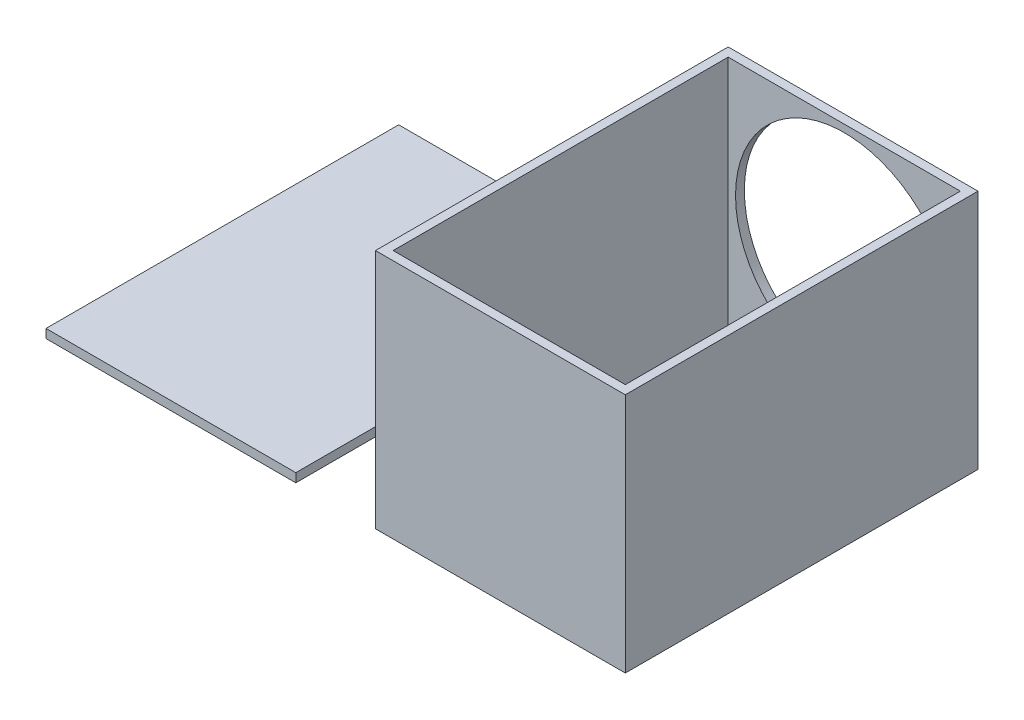
ISO-10303-21;
HEADER;
FILE_DESCRIPTION(('STEP AP214'),'2;1');
FILE_NAME('part.step','',(''),(''),'','','');
FILE_SCHEMA(('AUTOMOTIVE_DESIGN { 1 0 10303 214 1 1 1 1 }'));
ENDSEC;
DATA;
#1=APPLICATION_CONTEXT('core data for automotive mechanical design processes');
#2=APPLICATION_PROTOCOL_DEFINITION('international standard','automotive_design',2000,#1);
#3=PRODUCT_CONTEXT('',#1,'mechanical');
#4=PRODUCT('Part','Part','',(#3));
#5=PRODUCT_RELATED_PRODUCT_CATEGORY('part','',(#4));
#6=PRODUCT_DEFINITION_FORMATION('','',#4);
#7=PRODUCT_DEFINITION_CONTEXT('part definition',#1,'design');
#8=PRODUCT_DEFINITION('design','',#6,#7);
#9=PRODUCT_DEFINITION_SHAPE('','',#8);
#10=(LENGTH_UNIT() NAMED_UNIT(*) SI_UNIT(.MILLI.,.METRE.));
#11=(NAMED_UNIT(*) PLANE_ANGLE_UNIT() SI_UNIT($,.RADIAN.));
#12=(NAMED_UNIT(*) SI_UNIT($,.STERADIAN.) SOLID_ANGLE_UNIT());
#13=UNCERTAINTY_MEASURE_WITH_UNIT(LENGTH_MEASURE(1.E-05),#10,'distance_accuracy_value','');
#14=(GEOMETRIC_REPRESENTATION_CONTEXT(3) GLOBAL_UNCERTAINTY_ASSIGNED_CONTEXT((#13)) GLOBAL_UNIT_ASSIGNED_CONTEXT((#10,
#11,#12)) REPRESENTATION_CONTEXT('',''));
#15=CARTESIAN_POINT('',(0.,0.,0.));
#16=DIRECTION('',(0.,0.,1.));
#17=DIRECTION('',(1.,0.,0.));
#18=AXIS2_PLACEMENT_3D('',#15,#16,#17);
#19=CARTESIAN_POINT('',(-27.1085946374114,3.00000000000001,120.));
#20=DIRECTION('',(0.,-1.,0.));
#21=DIRECTION('',(1.,0.,0.));
#22=AXIS2_PLACEMENT_3D('',#19,#20,#21);
#23=PLANE('',#22);
#24=DIRECTION('',(-1.,0.,0.));
#25=VECTOR('',#24,1.);
#26=CARTESIAN_POINT('',(-27.1085946374114,3.00000000000001,0.));
#27=LINE('',#26,#25);
#28=CARTESIAN_POINT('',(-27.1085946374114,3.00000000000001,0.));
#29=VERTEX_POINT('',#28);
#30=CARTESIAN_POINT('',(-112.108594637411,3.,0.));
#31=VERTEX_POINT('',#30);
#32=EDGE_CURVE('E123',#29,#31,#27,.T.);
#33=ORIENTED_EDGE('',*,*,#32,.T.);
#34=DIRECTION('',(0.,0.,-1.));
#35=VECTOR('',#34,1.);
#36=CARTESIAN_POINT('',(-112.108594637411,3.,120.));
#37=LINE('',#36,#35);
#38=CARTESIAN_POINT('',(-112.108594637411,3.,120.));
#39=VERTEX_POINT('',#38);
#40=EDGE_CURVE('E13',#39,#31,#37,.T.);
#41=ORIENTED_EDGE('',*,*,#40,.F.);
#42=DIRECTION('',(-1.,0.,0.));
#43=VECTOR('',#42,1.);
#44=CARTESIAN_POINT('',(-27.1085946374114,3.00000000000001,120.));
#45=LINE('',#44,#43);
#46=CARTESIAN_POINT('',(-27.1085946374114,3.00000000000001,120.));
#47=VERTEX_POINT('',#46);
#48=EDGE_CURVE('E109',#47,#39,#45,.T.);
#49=ORIENTED_EDGE('',*,*,#48,.F.);
#50=DIRECTION('',(0.,0.,-1.));
#51=VECTOR('',#50,1.);
#52=CARTESIAN_POINT('',(-27.1085946374114,3.00000000000001,120.));
#53=LINE('',#52,#51);
#54=EDGE_CURVE('E76',#47,#29,#53,.T.);
#55=ORIENTED_EDGE('',*,*,#54,.T.);
#56=EDGE_LOOP('',(#33,#41,#49,#55));
#57=FACE_BOUND('',#56,.T.);
#58=ADVANCED_FACE('F60',(#57),#23,.F.);
#59=CARTESIAN_POINT('',(-112.108594637411,3.,120.));
#60=DIRECTION('',(1.,0.,0.));
#61=DIRECTION('',(0.,0.,-1.));
#62=AXIS2_PLACEMENT_3D('',#59,#60,#61);
#63=PLANE('',#62);
#64=DIRECTION('',(0.,-1.,0.));
#65=VECTOR('',#64,1.);
#66=CARTESIAN_POINT('',(-112.108594637411,3.,0.));
#67=LINE('',#66,#65);
#68=CARTESIAN_POINT('',(-112.108594637411,0.,0.));
#69=VERTEX_POINT('',#68);
#70=EDGE_CURVE('E114',#31,#69,#67,.T.);
#71=ORIENTED_EDGE('',*,*,#70,.T.);
#72=DIRECTION('',(0.,0.,-1.));
#73=VECTOR('',#72,1.);
#74=CARTESIAN_POINT('',(-112.108594637411,0.,120.));
#75=LINE('',#74,#73);
#76=CARTESIAN_POINT('',(-112.108594637411,0.,120.));
#77=VERTEX_POINT('',#76);
#78=EDGE_CURVE('E68',#77,#69,#75,.T.);
#79=ORIENTED_EDGE('',*,*,#78,.F.);
#80=DIRECTION('',(0.,-1.,0.));
#81=VECTOR('',#80,1.);
#82=CARTESIAN_POINT('',(-112.108594637411,3.,120.));
#83=LINE('',#82,#81);
#84=EDGE_CURVE('E101',#39,#77,#83,.T.);
#85=ORIENTED_EDGE('',*,*,#84,.F.);
#86=ORIENTED_EDGE('',*,*,#40,.T.);
#87=EDGE_LOOP('',(#71,#79,#85,#86));
#88=FACE_BOUND('',#87,.T.);
#89=ADVANCED_FACE('F113',(#88),#63,.F.);
#90=CARTESIAN_POINT('',(-27.1085946374114,0.,120.));
#91=DIRECTION('',(0.,-1.,0.));
#92=DIRECTION('',(1.,0.,0.));
#93=AXIS2_PLACEMENT_3D('',#90,#91,#92);
#94=PLANE('',#93);
#95=DIRECTION('',(-1.,0.,0.));
#96=VECTOR('',#95,1.);
#97=CARTESIAN_POINT('',(-27.1085946374114,0.,0.));
#98=LINE('',#97,#96);
#99=CARTESIAN_POINT('',(-27.1085946374114,0.,0.));
#100=VERTEX_POINT('',#99);
#101=EDGE_CURVE('E126',#100,#69,#98,.T.);
#102=ORIENTED_EDGE('',*,*,#101,.F.);
#103=DIRECTION('',(0.,0.,-1.));
#104=VECTOR('',#103,1.);
#105=CARTESIAN_POINT('',(-27.1085946374114,0.,120.));
#106=LINE('',#105,#104);
#107=CARTESIAN_POINT('',(-27.1085946374114,0.,120.));
#108=VERTEX_POINT('',#107);
#109=EDGE_CURVE('E90',#108,#100,#106,.T.);
#110=ORIENTED_EDGE('',*,*,#109,.F.);
#111=DIRECTION('',(-1.,0.,0.));
#112=VECTOR('',#111,1.);
#113=CARTESIAN_POINT('',(-27.1085946374114,0.,120.));
#114=LINE('',#113,#112);
#115=EDGE_CURVE('E108',#108,#77,#114,.T.);
#116=ORIENTED_EDGE('',*,*,#115,.T.);
#117=ORIENTED_EDGE('',*,*,#78,.T.);
#118=EDGE_LOOP('',(#102,#110,#116,#117));
#119=FACE_BOUND('',#118,.T.);
#120=ADVANCED_FACE('F117',(#119),#94,.T.);
#121=CARTESIAN_POINT('',(-27.1085946374114,3.00000000000001,120.));
#122=DIRECTION('',(1.,0.,0.));
#123=DIRECTION('',(0.,0.,-1.));
#124=AXIS2_PLACEMENT_3D('',#121,#122,#123);
#125=PLANE('',#124);
#126=DIRECTION('',(0.,-1.,0.));
#127=VECTOR('',#126,1.);
#128=CARTESIAN_POINT('',(-27.1085946374114,3.00000000000001,0.));
#129=LINE('',#128,#127);
#130=EDGE_CURVE('E128',#29,#100,#129,.T.);
#131=ORIENTED_EDGE('',*,*,#130,.F.);
#132=ORIENTED_EDGE('',*,*,#54,.F.);
#133=DIRECTION('',(0.,-1.,0.));
#134=VECTOR('',#133,1.);
#135=CARTESIAN_POINT('',(-27.1085946374114,3.00000000000001,120.));
#136=LINE('',#135,#134);
#137=EDGE_CURVE('E118',#47,#108,#136,.T.);
#138=ORIENTED_EDGE('',*,*,#137,.T.);
#139=ORIENTED_EDGE('',*,*,#109,.T.);
#140=EDGE_LOOP('',(#131,#132,#138,#139));
#141=FACE_BOUND('',#140,.T.);
#142=ADVANCED_FACE('F134',(#141),#125,.T.);
#143=CARTESIAN_POINT('',(0.,0.,120.));
#144=DIRECTION('',(0.,0.,1.));
#145=DIRECTION('',(1.,0.,0.));
#146=AXIS2_PLACEMENT_3D('',#143,#144,#145);
#147=PLANE('',#146);
#148=ORIENTED_EDGE('',*,*,#48,.T.);
#149=ORIENTED_EDGE('',*,*,#84,.T.);
#150=ORIENTED_EDGE('',*,*,#115,.F.);
#151=ORIENTED_EDGE('',*,*,#137,.F.);
#152=EDGE_LOOP('',(#148,#149,#150,#151));
#153=FACE_BOUND('',#152,.T.);
#154=ADVANCED_FACE('F105',(#153),#147,.T.);
#155=CARTESIAN_POINT('',(0.,0.,0.));
#156=DIRECTION('',(0.,0.,1.));
#157=DIRECTION('',(1.,0.,0.));
#158=AXIS2_PLACEMENT_3D('',#155,#156,#157);
#159=PLANE('',#158);
#160=ORIENTED_EDGE('',*,*,#32,.F.);
#161=ORIENTED_EDGE('',*,*,#130,.T.);
#162=ORIENTED_EDGE('',*,*,#101,.T.);
#163=ORIENTED_EDGE('',*,*,#70,.F.);
#164=EDGE_LOOP('',(#160,#161,#162,#163));
#165=FACE_BOUND('',#164,.T.);
#166=ADVANCED_FACE('F133',(#165),#159,.F.);
#167=CLOSED_SHELL('',(#58,#89,#120,#142,#154,#166));
#168=MANIFOLD_SOLID_BREP('B2',#167);
#169=CARTESIAN_POINT('',(0.,0.,3.));
#170=DIRECTION('',(0.,0.,1.));
#171=DIRECTION('',(1.,0.,0.));
#172=AXIS2_PLACEMENT_3D('',#169,#170,#171);
#173=PLANE('',#172);
#174=CARTESIAN_POINT('',(42.5,42.5,3.));
#175=DIRECTION('',(0.,0.,1.));
#176=DIRECTION('',(1.,0.,0.));
#177=AXIS2_PLACEMENT_3D('',#174,#175,#176);
#178=CIRCLE('',#177,37.);
#179=CARTESIAN_POINT('',(79.5,42.5,3.));
#180=VERTEX_POINT('',#179);
#181=EDGE_CURVE('E296',#180,#180,#178,.T.);
#182=ORIENTED_EDGE('',*,*,#181,.F.);
#183=EDGE_LOOP('',(#182));
#184=FACE_BOUND('',#183,.T.);
#185=DIRECTION('',(1.,0.,0.));
#186=VECTOR('',#185,1.);
#187=CARTESIAN_POINT('',(3.00000000000001,3.,3.));
#188=LINE('',#187,#186);
#189=CARTESIAN_POINT('',(3.00000000000001,3.00000000000003,3.));
#190=VERTEX_POINT('',#189);
#191=CARTESIAN_POINT('',(82.,3.,3.));
#192=VERTEX_POINT('',#191);
#193=EDGE_CURVE('E257',#190,#192,#188,.T.);
#194=ORIENTED_EDGE('',*,*,#193,.T.);
#195=DIRECTION('',(0.,-1.,0.));
#196=VECTOR('',#195,1.);
#197=CARTESIAN_POINT('',(82.,82.,3.));
#198=LINE('',#197,#196);
#199=CARTESIAN_POINT('',(82.,82.,3.));
#200=VERTEX_POINT('',#199);
#201=EDGE_CURVE('E266',#200,#192,#198,.T.);
#202=ORIENTED_EDGE('',*,*,#201,.F.);
#203=DIRECTION('',(1.,0.,0.));
#204=VECTOR('',#203,1.);
#205=CARTESIAN_POINT('',(0.,82.,3.));
#206=LINE('',#205,#204);
#207=CARTESIAN_POINT('',(3.,82.,3.));
#208=VERTEX_POINT('',#207);
#209=EDGE_CURVE('E253',#208,#200,#206,.T.);
#210=ORIENTED_EDGE('',*,*,#209,.F.);
#211=DIRECTION('',(0.,-1.,0.));
#212=VECTOR('',#211,1.);
#213=CARTESIAN_POINT('',(3.,82.,3.));
#214=LINE('',#213,#212);
#215=EDGE_CURVE('E283',#208,#190,#214,.T.);
#216=ORIENTED_EDGE('',*,*,#215,.T.);
#217=EDGE_LOOP('',(#194,#202,#210,#216));
#218=FACE_BOUND('',#217,.T.);
#219=ADVANCED_FACE('F183',(#184,#218),#173,.T.);
#220=CARTESIAN_POINT('',(3.00000000000001,3.,120.));
#221=DIRECTION('',(0.,1.,0.));
#222=DIRECTION('',(0.,0.,1.));
#223=AXIS2_PLACEMENT_3D('',#220,#221,#222);
#224=PLANE('',#223);
#225=DIRECTION('',(1.,0.,0.));
#226=VECTOR('',#225,1.);
#227=CARTESIAN_POINT('',(3.,3.,117.));
#228=LINE('',#227,#226);
#229=CARTESIAN_POINT('',(3.00000000000001,3.,117.));
#230=VERTEX_POINT('',#229);
#231=CARTESIAN_POINT('',(82.,3.00000000000003,117.));
#232=VERTEX_POINT('',#231);
#233=EDGE_CURVE('E269',#230,#232,#228,.T.);
#234=ORIENTED_EDGE('',*,*,#233,.T.);
#235=DIRECTION('',(0.,0.,-1.));
#236=VECTOR('',#235,1.);
#237=CARTESIAN_POINT('',(82.,3.00000000000003,120.));
#238=LINE('',#237,#236);
#239=EDGE_CURVE('E258',#232,#192,#238,.T.);
#240=ORIENTED_EDGE('',*,*,#239,.T.);
#241=ORIENTED_EDGE('',*,*,#193,.F.);
#242=DIRECTION('',(0.,0.,-1.));
#243=VECTOR('',#242,1.);
#244=CARTESIAN_POINT('',(3.00000000000001,3.,120.));
#245=LINE('',#244,#243);
#246=EDGE_CURVE('E279',#230,#190,#245,.T.);
#247=ORIENTED_EDGE('',*,*,#246,.F.);
#248=EDGE_LOOP('',(#234,#240,#241,#247));
#249=FACE_BOUND('',#248,.T.);
#250=ADVANCED_FACE('F340',(#249),#224,.T.);
#251=CARTESIAN_POINT('',(0.,0.,0.));
#252=DIRECTION('',(0.,0.,1.));
#253=DIRECTION('',(1.,0.,0.));
#254=AXIS2_PLACEMENT_3D('',#251,#252,#253);
#255=PLANE('',#254);
#256=DIRECTION('',(0.,-1.,0.));
#257=VECTOR('',#256,1.);
#258=CARTESIAN_POINT('',(0.,82.,0.));
#259=LINE('',#258,#257);
#260=CARTESIAN_POINT('',(0.,82.,0.));
#261=VERTEX_POINT('',#260);
#262=CARTESIAN_POINT('',(0.,0.,0.));
#263=VERTEX_POINT('',#262);
#264=EDGE_CURVE('E299',#261,#263,#259,.T.);
#265=ORIENTED_EDGE('',*,*,#264,.F.);
#266=DIRECTION('',(1.,0.,0.));
#267=VECTOR('',#266,1.);
#268=CARTESIAN_POINT('',(0.,82.,0.));
#269=LINE('',#268,#267);
#270=CARTESIAN_POINT('',(85.,82.,0.));
#271=VERTEX_POINT('',#270);
#272=EDGE_CURVE('E304',#261,#271,#269,.T.);
#273=ORIENTED_EDGE('',*,*,#272,.T.);
#274=DIRECTION('',(0.,-1.,0.));
#275=VECTOR('',#274,1.);
#276=CARTESIAN_POINT('',(85.,82.,0.));
#277=LINE('',#276,#275);
#278=CARTESIAN_POINT('',(85.,0.,0.));
#279=VERTEX_POINT('',#278);
#280=EDGE_CURVE('E310',#271,#279,#277,.T.);
#281=ORIENTED_EDGE('',*,*,#280,.T.);
#282=DIRECTION('',(1.,0.,0.));
#283=VECTOR('',#282,1.);
#284=CARTESIAN_POINT('',(0.,0.,0.));
#285=LINE('',#284,#283);
#286=EDGE_CURVE('E307',#263,#279,#285,.T.);
#287=ORIENTED_EDGE('',*,*,#286,.F.);
#288=EDGE_LOOP('',(#265,#273,#281,#287));
#289=FACE_BOUND('',#288,.T.);
#290=CARTESIAN_POINT('',(42.5,42.5,0.));
#291=DIRECTION('',(0.,0.,1.));
#292=DIRECTION('',(1.,0.,0.));
#293=AXIS2_PLACEMENT_3D('',#290,#291,#292);
#294=CIRCLE('',#293,37.);
#295=CARTESIAN_POINT('',(79.5,42.5,0.));
#296=VERTEX_POINT('',#295);
#297=EDGE_CURVE('E295',#296,#296,#294,.T.);
#298=ORIENTED_EDGE('',*,*,#297,.T.);
#299=EDGE_LOOP('',(#298));
#300=FACE_BOUND('',#299,.T.);
#301=ADVANCED_FACE('F327',(#289,#300),#255,.F.);
#302=CARTESIAN_POINT('',(0.,82.,3.));
#303=DIRECTION('',(1.,0.,0.));
#304=DIRECTION('',(0.,0.,-1.));
#305=AXIS2_PLACEMENT_3D('',#302,#303,#304);
#306=PLANE('',#305);
#307=ORIENTED_EDGE('',*,*,#264,.T.);
#308=DIRECTION('',(0.,0.,-1.));
#309=VECTOR('',#308,1.);
#310=CARTESIAN_POINT('',(0.,0.,3.));
#311=LINE('',#310,#309);
#312=CARTESIAN_POINT('',(0.,0.,120.));
#313=VERTEX_POINT('',#312);
#314=EDGE_CURVE('E58',#313,#263,#311,.T.);
#315=ORIENTED_EDGE('',*,*,#314,.F.);
#316=DIRECTION('',(0.,-1.,0.));
#317=VECTOR('',#316,1.);
#318=CARTESIAN_POINT('',(0.,82.,120.));
#319=LINE('',#318,#317);
#320=CARTESIAN_POINT('',(0.,82.,120.));
#321=VERTEX_POINT('',#320);
#322=EDGE_CURVE('E284',#321,#313,#319,.T.);
#323=ORIENTED_EDGE('',*,*,#322,.F.);
#324=DIRECTION('',(0.,0.,-1.));
#325=VECTOR('',#324,1.);
#326=CARTESIAN_POINT('',(0.,82.,3.));
#327=LINE('',#326,#325);
#328=EDGE_CURVE('E303',#321,#261,#327,.T.);
#329=ORIENTED_EDGE('',*,*,#328,.T.);
#330=EDGE_LOOP('',(#307,#315,#323,#329));
#331=FACE_BOUND('',#330,.T.);
#332=ADVANCED_FACE('F185',(#331),#306,.F.);
#333=CARTESIAN_POINT('',(0.,0.,3.));
#334=DIRECTION('',(0.,1.,0.));
#335=DIRECTION('',(-1.,0.,0.));
#336=AXIS2_PLACEMENT_3D('',#333,#334,#335);
#337=PLANE('',#336);
#338=DIRECTION('',(0.,0.,-1.));
#339=VECTOR('',#338,1.);
#340=CARTESIAN_POINT('',(85.,0.,3.));
#341=LINE('',#340,#339);
#342=CARTESIAN_POINT('',(85.,0.,120.));
#343=VERTEX_POINT('',#342);
#344=EDGE_CURVE('E191',#343,#279,#341,.T.);
#345=ORIENTED_EDGE('',*,*,#344,.F.);
#346=DIRECTION('',(1.,0.,0.));
#347=VECTOR('',#346,1.);
#348=CARTESIAN_POINT('',(0.,0.,120.));
#349=LINE('',#348,#347);
#350=EDGE_CURVE('E287',#313,#343,#349,.T.);
#351=ORIENTED_EDGE('',*,*,#350,.F.);
#352=ORIENTED_EDGE('',*,*,#314,.T.);
#353=ORIENTED_EDGE('',*,*,#286,.T.);
#354=EDGE_LOOP('',(#345,#351,#352,#353));
#355=FACE_BOUND('',#354,.T.);
#356=ADVANCED_FACE('F324',(#355),#337,.F.);
#357=CARTESIAN_POINT('',(85.,82.,3.));
#358=DIRECTION('',(1.,0.,0.));
#359=DIRECTION('',(0.,1.,0.));
#360=AXIS2_PLACEMENT_3D('',#357,#358,#359);
#361=PLANE('',#360);
#362=ORIENTED_EDGE('',*,*,#280,.F.);
#363=DIRECTION('',(0.,0.,-1.));
#364=VECTOR('',#363,1.);
#365=CARTESIAN_POINT('',(85.,82.,3.));
#366=LINE('',#365,#364);
#367=CARTESIAN_POINT('',(85.,82.,120.));
#368=VERTEX_POINT('',#367);
#369=EDGE_CURVE('E316',#368,#271,#366,.T.);
#370=ORIENTED_EDGE('',*,*,#369,.F.);
#371=DIRECTION('',(0.,1.,0.));
#372=VECTOR('',#371,1.);
#373=CARTESIAN_POINT('',(85.,0.,120.));
#374=LINE('',#373,#372);
#375=EDGE_CURVE('E276',#343,#368,#374,.T.);
#376=ORIENTED_EDGE('',*,*,#375,.F.);
#377=ORIENTED_EDGE('',*,*,#344,.T.);
#378=EDGE_LOOP('',(#362,#370,#376,#377));
#379=FACE_BOUND('',#378,.T.);
#380=ADVANCED_FACE('F320',(#379),#361,.T.);
#381=CARTESIAN_POINT('',(0.,82.,3.));
#382=DIRECTION('',(0.,1.,0.));
#383=DIRECTION('',(0.,0.,1.));
#384=AXIS2_PLACEMENT_3D('',#381,#382,#383);
#385=PLANE('',#384);
#386=DIRECTION('',(1.,0.,0.));
#387=VECTOR('',#386,1.);
#388=CARTESIAN_POINT('',(3.,82.,117.));
#389=LINE('',#388,#387);
#390=CARTESIAN_POINT('',(3.,82.,117.));
#391=VERTEX_POINT('',#390);
#392=CARTESIAN_POINT('',(82.,82.,117.));
#393=VERTEX_POINT('',#392);
#394=EDGE_CURVE('E251',#391,#393,#389,.T.);
#395=ORIENTED_EDGE('',*,*,#394,.F.);
#396=DIRECTION('',(0.,0.,-1.));
#397=VECTOR('',#396,1.);
#398=CARTESIAN_POINT('',(3.,82.,120.));
#399=LINE('',#398,#397);
#400=EDGE_CURVE('E198',#391,#208,#399,.T.);
#401=ORIENTED_EDGE('',*,*,#400,.T.);
#402=ORIENTED_EDGE('',*,*,#209,.T.);
#403=DIRECTION('',(0.,0.,-1.));
#404=VECTOR('',#403,1.);
#405=CARTESIAN_POINT('',(82.,82.,120.));
#406=LINE('',#405,#404);
#407=EDGE_CURVE('E246',#393,#200,#406,.T.);
#408=ORIENTED_EDGE('',*,*,#407,.F.);
#409=EDGE_LOOP('',(#395,#401,#402,#408));
#410=FACE_BOUND('',#409,.T.);
#411=ORIENTED_EDGE('',*,*,#272,.F.);
#412=ORIENTED_EDGE('',*,*,#328,.F.);
#413=DIRECTION('',(1.,0.,0.));
#414=VECTOR('',#413,1.);
#415=CARTESIAN_POINT('',(0.,82.,120.));
#416=LINE('',#415,#414);
#417=EDGE_CURVE('E290',#321,#368,#416,.T.);
#418=ORIENTED_EDGE('',*,*,#417,.T.);
#419=ORIENTED_EDGE('',*,*,#369,.T.);
#420=EDGE_LOOP('',(#411,#412,#418,#419));
#421=FACE_BOUND('',#420,.T.);
#422=ADVANCED_FACE('F248',(#410,#421),#385,.T.);
#423=CARTESIAN_POINT('',(42.5,42.5,3.));
#424=DIRECTION('',(0.,0.,-1.));
#425=DIRECTION('',(-1.,0.,0.));
#426=AXIS2_PLACEMENT_3D('',#423,#424,#425);
#427=CYLINDRICAL_SURFACE('',#426,37.);
#428=ORIENTED_EDGE('',*,*,#181,.T.);
#429=EDGE_LOOP('',(#428));
#430=FACE_BOUND('',#429,.T.);
#431=ORIENTED_EDGE('',*,*,#297,.F.);
#432=EDGE_LOOP('',(#431));
#433=FACE_BOUND('',#432,.T.);
#434=ADVANCED_FACE('F353',(#430,#433),#427,.F.);
#435=CARTESIAN_POINT('',(3.,82.,120.));
#436=DIRECTION('',(1.,0.,0.));
#437=DIRECTION('',(0.,1.,0.));
#438=AXIS2_PLACEMENT_3D('',#435,#436,#437);
#439=PLANE('',#438);
#440=DIRECTION('',(0.,-1.,0.));
#441=VECTOR('',#440,1.);
#442=CARTESIAN_POINT('',(3.,82.,117.));
#443=LINE('',#442,#441);
#444=EDGE_CURVE('E202',#391,#230,#443,.T.);
#445=ORIENTED_EDGE('',*,*,#444,.T.);
#446=ORIENTED_EDGE('',*,*,#246,.T.);
#447=ORIENTED_EDGE('',*,*,#215,.F.);
#448=ORIENTED_EDGE('',*,*,#400,.F.);
#449=EDGE_LOOP('',(#445,#446,#447,#448));
#450=FACE_BOUND('',#449,.T.);
#451=ADVANCED_FACE('F375',(#450),#439,.T.);
#452=CARTESIAN_POINT('',(0.,0.,120.));
#453=DIRECTION('',(0.,0.,1.));
#454=DIRECTION('',(1.,0.,0.));
#455=AXIS2_PLACEMENT_3D('',#452,#453,#454);
#456=PLANE('',#455);
#457=ORIENTED_EDGE('',*,*,#322,.T.);
#458=ORIENTED_EDGE('',*,*,#350,.T.);
#459=ORIENTED_EDGE('',*,*,#375,.T.);
#460=ORIENTED_EDGE('',*,*,#417,.F.);
#461=EDGE_LOOP('',(#457,#458,#459,#460));
#462=FACE_BOUND('',#461,.T.);
#463=ADVANCED_FACE('F333',(#462),#456,.T.);
#464=CARTESIAN_POINT('',(82.,82.,120.));
#465=DIRECTION('',(1.,0.,0.));
#466=DIRECTION('',(0.,1.,0.));
#467=AXIS2_PLACEMENT_3D('',#464,#465,#466);
#468=PLANE('',#467);
#469=ORIENTED_EDGE('',*,*,#239,.F.);
#470=DIRECTION('',(0.,-1.,0.));
#471=VECTOR('',#470,1.);
#472=CARTESIAN_POINT('',(82.,82.,117.));
#473=LINE('',#472,#471);
#474=EDGE_CURVE('E262',#393,#232,#473,.T.);
#475=ORIENTED_EDGE('',*,*,#474,.F.);
#476=ORIENTED_EDGE('',*,*,#407,.T.);
#477=ORIENTED_EDGE('',*,*,#201,.T.);
#478=EDGE_LOOP('',(#469,#475,#476,#477));
#479=FACE_BOUND('',#478,.T.);
#480=ADVANCED_FACE('F263',(#479),#468,.F.);
#481=CARTESIAN_POINT('',(3.,82.,117.));
#482=DIRECTION('',(0.,0.,-1.));
#483=DIRECTION('',(-1.,0.,0.));
#484=AXIS2_PLACEMENT_3D('',#481,#482,#483);
#485=PLANE('',#484);
#486=ORIENTED_EDGE('',*,*,#233,.F.);
#487=ORIENTED_EDGE('',*,*,#444,.F.);
#488=ORIENTED_EDGE('',*,*,#394,.T.);
#489=ORIENTED_EDGE('',*,*,#474,.T.);
#490=EDGE_LOOP('',(#486,#487,#488,#489));
#491=FACE_BOUND('',#490,.T.);
#492=ADVANCED_FACE('F268',(#491),#485,.T.);
#493=CLOSED_SHELL('',(#219,#250,#301,#332,#356,#380,#422,#434,#451,#463,#480,#492));
#494=MANIFOLD_SOLID_BREP('B7',#493);
#495=ADVANCED_BREP_SHAPE_REPRESENTATION('',(#18,#168,#494),#14);
#496=SHAPE_DEFINITION_REPRESENTATION(#9,#495);
ENDSEC;
END-ISO-10303-21;
